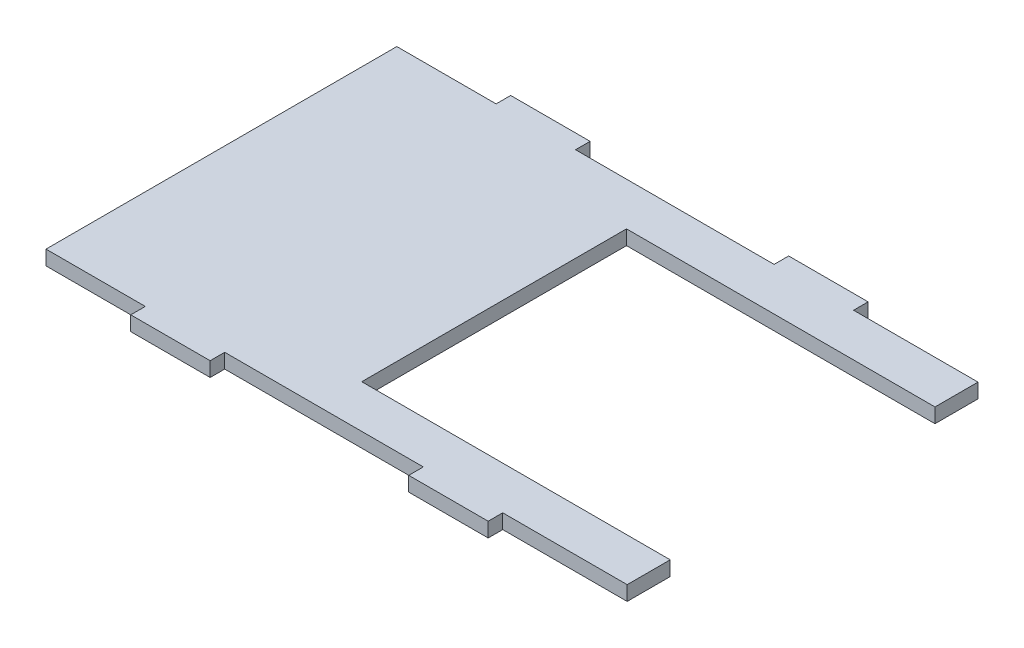
ISO-10303-21;
HEADER;
FILE_DESCRIPTION(('STEP AP214'),'2;1');
FILE_NAME('part.step','',(''),(''),'','','');
FILE_SCHEMA(('AUTOMOTIVE_DESIGN { 1 0 10303 214 1 1 1 1 }'));
ENDSEC;
DATA;
#1=APPLICATION_CONTEXT('core data for automotive mechanical design processes');
#2=APPLICATION_PROTOCOL_DEFINITION('international standard','automotive_design',2000,#1);
#3=PRODUCT_CONTEXT('',#1,'mechanical');
#4=PRODUCT('Part','Part','',(#3));
#5=PRODUCT_RELATED_PRODUCT_CATEGORY('part','',(#4));
#6=PRODUCT_DEFINITION_FORMATION('','',#4);
#7=PRODUCT_DEFINITION_CONTEXT('part definition',#1,'design');
#8=PRODUCT_DEFINITION('design','',#6,#7);
#9=PRODUCT_DEFINITION_SHAPE('','',#8);
#10=(LENGTH_UNIT() NAMED_UNIT(*) SI_UNIT(.MILLI.,.METRE.));
#11=(NAMED_UNIT(*) PLANE_ANGLE_UNIT() SI_UNIT($,.RADIAN.));
#12=(NAMED_UNIT(*) SI_UNIT($,.STERADIAN.) SOLID_ANGLE_UNIT());
#13=UNCERTAINTY_MEASURE_WITH_UNIT(LENGTH_MEASURE(1.E-05),#10,'distance_accuracy_value','');
#14=(GEOMETRIC_REPRESENTATION_CONTEXT(3) GLOBAL_UNCERTAINTY_ASSIGNED_CONTEXT((#13)) GLOBAL_UNIT_ASSIGNED_CONTEXT((#10,
#11,#12)) REPRESENTATION_CONTEXT('',''));
#15=CARTESIAN_POINT('',(0.,0.,0.));
#16=DIRECTION('',(0.,0.,1.));
#17=DIRECTION('',(1.,0.,0.));
#18=AXIS2_PLACEMENT_3D('',#15,#16,#17);
#19=CARTESIAN_POINT('',(0.,2.794,0.));
#20=DIRECTION('',(1.,0.,0.));
#21=DIRECTION('',(0.,0.,-1.));
#22=AXIS2_PLACEMENT_3D('',#19,#20,#21);
#23=PLANE('',#22);
#24=DIRECTION('',(0.,0.,1.));
#25=VECTOR('',#24,1.);
#26=CARTESIAN_POINT('',(0.,0.,0.));
#27=LINE('',#26,#25);
#28=CARTESIAN_POINT('',(0.,0.,-67.31));
#29=VERTEX_POINT('',#28);
#30=CARTESIAN_POINT('',(0.,0.,0.));
#31=VERTEX_POINT('',#30);
#32=EDGE_CURVE('E225',#29,#31,#27,.T.);
#33=ORIENTED_EDGE('',*,*,#32,.T.);
#34=DIRECTION('',(0.,-1.,0.));
#35=VECTOR('',#34,1.);
#36=CARTESIAN_POINT('',(0.,2.794,0.));
#37=LINE('',#36,#35);
#38=CARTESIAN_POINT('',(0.,2.794,0.));
#39=VERTEX_POINT('',#38);
#40=EDGE_CURVE('E11',#39,#31,#37,.T.);
#41=ORIENTED_EDGE('',*,*,#40,.F.);
#42=DIRECTION('',(0.,0.,1.));
#43=VECTOR('',#42,1.);
#44=CARTESIAN_POINT('',(0.,2.794,0.));
#45=LINE('',#44,#43);
#46=CARTESIAN_POINT('',(0.,2.794,-67.31));
#47=VERTEX_POINT('',#46);
#48=EDGE_CURVE('E271',#47,#39,#45,.T.);
#49=ORIENTED_EDGE('',*,*,#48,.F.);
#50=DIRECTION('',(0.,-1.,0.));
#51=VECTOR('',#50,1.);
#52=CARTESIAN_POINT('',(0.,2.794,-67.31));
#53=LINE('',#52,#51);
#54=EDGE_CURVE('E221',#47,#29,#53,.T.);
#55=ORIENTED_EDGE('',*,*,#54,.T.);
#56=EDGE_LOOP('',(#33,#41,#49,#55));
#57=FACE_BOUND('',#56,.T.);
#58=ADVANCED_FACE('F33',(#57),#23,.F.);
#59=CARTESIAN_POINT('',(0.,2.794,0.));
#60=DIRECTION('',(0.,0.,-1.));
#61=DIRECTION('',(-1.,0.,0.));
#62=AXIS2_PLACEMENT_3D('',#59,#60,#61);
#63=PLANE('',#62);
#64=DIRECTION('',(1.,0.,0.));
#65=VECTOR('',#64,1.);
#66=CARTESIAN_POINT('',(0.,0.,0.));
#67=LINE('',#66,#65);
#68=CARTESIAN_POINT('',(19.05,0.,0.));
#69=VERTEX_POINT('',#68);
#70=EDGE_CURVE('E228',#31,#69,#67,.T.);
#71=ORIENTED_EDGE('',*,*,#70,.T.);
#72=DIRECTION('',(0.,-1.,0.));
#73=VECTOR('',#72,1.);
#74=CARTESIAN_POINT('',(19.05,2.794,0.));
#75=LINE('',#74,#73);
#76=CARTESIAN_POINT('',(19.05,2.794,0.));
#77=VERTEX_POINT('',#76);
#78=EDGE_CURVE('E41',#77,#69,#75,.T.);
#79=ORIENTED_EDGE('',*,*,#78,.F.);
#80=DIRECTION('',(1.,0.,0.));
#81=VECTOR('',#80,1.);
#82=CARTESIAN_POINT('',(0.,2.794,0.));
#83=LINE('',#82,#81);
#84=EDGE_CURVE('E140',#39,#77,#83,.T.);
#85=ORIENTED_EDGE('',*,*,#84,.F.);
#86=ORIENTED_EDGE('',*,*,#40,.T.);
#87=EDGE_LOOP('',(#71,#79,#85,#86));
#88=FACE_BOUND('',#87,.T.);
#89=ADVANCED_FACE('F409',(#88),#63,.F.);
#90=CARTESIAN_POINT('',(19.05,2.794,0.));
#91=DIRECTION('',(1.,0.,0.));
#92=DIRECTION('',(0.,0.,-1.));
#93=AXIS2_PLACEMENT_3D('',#90,#91,#92);
#94=PLANE('',#93);
#95=DIRECTION('',(0.,0.,1.));
#96=VECTOR('',#95,1.);
#97=CARTESIAN_POINT('',(19.05,0.,0.));
#98=LINE('',#97,#96);
#99=CARTESIAN_POINT('',(19.05,0.,2.794));
#100=VERTEX_POINT('',#99);
#101=EDGE_CURVE('E230',#69,#100,#98,.T.);
#102=ORIENTED_EDGE('',*,*,#101,.T.);
#103=DIRECTION('',(0.,-1.,0.));
#104=VECTOR('',#103,1.);
#105=CARTESIAN_POINT('',(19.05,2.794,2.794));
#106=LINE('',#105,#104);
#107=CARTESIAN_POINT('',(19.05,2.794,2.794));
#108=VERTEX_POINT('',#107);
#109=EDGE_CURVE('E326',#108,#100,#106,.T.);
#110=ORIENTED_EDGE('',*,*,#109,.F.);
#111=DIRECTION('',(0.,0.,1.));
#112=VECTOR('',#111,1.);
#113=CARTESIAN_POINT('',(19.05,2.794,0.));
#114=LINE('',#113,#112);
#115=EDGE_CURVE('E334',#77,#108,#114,.T.);
#116=ORIENTED_EDGE('',*,*,#115,.F.);
#117=ORIENTED_EDGE('',*,*,#78,.T.);
#118=EDGE_LOOP('',(#102,#110,#116,#117));
#119=FACE_BOUND('',#118,.T.);
#120=ADVANCED_FACE('F332',(#119),#94,.F.);
#121=CARTESIAN_POINT('',(19.05,2.794,2.794));
#122=DIRECTION('',(0.,0.,-1.));
#123=DIRECTION('',(-1.,0.,0.));
#124=AXIS2_PLACEMENT_3D('',#121,#122,#123);
#125=PLANE('',#124);
#126=DIRECTION('',(1.,0.,0.));
#127=VECTOR('',#126,1.);
#128=CARTESIAN_POINT('',(19.05,0.,2.794));
#129=LINE('',#128,#127);
#130=CARTESIAN_POINT('',(34.29,0.,2.79399999999991));
#131=VERTEX_POINT('',#130);
#132=EDGE_CURVE('E232',#100,#131,#129,.T.);
#133=ORIENTED_EDGE('',*,*,#132,.T.);
#134=DIRECTION('',(0.,-1.,0.));
#135=VECTOR('',#134,1.);
#136=CARTESIAN_POINT('',(34.29,2.794,2.79399999999991));
#137=LINE('',#136,#135);
#138=CARTESIAN_POINT('',(34.29,2.794,2.79399999999991));
#139=VERTEX_POINT('',#138);
#140=EDGE_CURVE('E323',#139,#131,#137,.T.);
#141=ORIENTED_EDGE('',*,*,#140,.F.);
#142=DIRECTION('',(1.,0.,0.));
#143=VECTOR('',#142,1.);
#144=CARTESIAN_POINT('',(19.05,2.794,2.794));
#145=LINE('',#144,#143);
#146=EDGE_CURVE('E352',#108,#139,#145,.T.);
#147=ORIENTED_EDGE('',*,*,#146,.F.);
#148=ORIENTED_EDGE('',*,*,#109,.T.);
#149=EDGE_LOOP('',(#133,#141,#147,#148));
#150=FACE_BOUND('',#149,.T.);
#151=ADVANCED_FACE('F343',(#150),#125,.F.);
#152=CARTESIAN_POINT('',(34.29,2.794,0.));
#153=DIRECTION('',(-1.,0.,0.));
#154=DIRECTION('',(0.,0.,1.));
#155=AXIS2_PLACEMENT_3D('',#152,#153,#154);
#156=PLANE('',#155);
#157=DIRECTION('',(0.,0.,-1.));
#158=VECTOR('',#157,1.);
#159=CARTESIAN_POINT('',(34.29,0.,0.));
#160=LINE('',#159,#158);
#161=CARTESIAN_POINT('',(34.29,0.,0.));
#162=VERTEX_POINT('',#161);
#163=EDGE_CURVE('E234',#131,#162,#160,.T.);
#164=ORIENTED_EDGE('',*,*,#163,.T.);
#165=DIRECTION('',(0.,-1.,0.));
#166=VECTOR('',#165,1.);
#167=CARTESIAN_POINT('',(34.29,2.794,0.));
#168=LINE('',#167,#166);
#169=CARTESIAN_POINT('',(34.29,2.794,0.));
#170=VERTEX_POINT('',#169);
#171=EDGE_CURVE('E320',#170,#162,#168,.T.);
#172=ORIENTED_EDGE('',*,*,#171,.F.);
#173=DIRECTION('',(0.,0.,-1.));
#174=VECTOR('',#173,1.);
#175=CARTESIAN_POINT('',(34.29,2.794,0.));
#176=LINE('',#175,#174);
#177=EDGE_CURVE('E349',#139,#170,#176,.T.);
#178=ORIENTED_EDGE('',*,*,#177,.F.);
#179=ORIENTED_EDGE('',*,*,#140,.T.);
#180=EDGE_LOOP('',(#164,#172,#178,#179));
#181=FACE_BOUND('',#180,.T.);
#182=ADVANCED_FACE('F347',(#181),#156,.F.);
#183=CARTESIAN_POINT('',(34.29,2.794,0.));
#184=DIRECTION('',(0.,0.,-1.));
#185=DIRECTION('',(-1.,0.,0.));
#186=AXIS2_PLACEMENT_3D('',#183,#184,#185);
#187=PLANE('',#186);
#188=DIRECTION('',(1.,0.,0.));
#189=VECTOR('',#188,1.);
#190=CARTESIAN_POINT('',(34.29,0.,0.));
#191=LINE('',#190,#189);
#192=CARTESIAN_POINT('',(72.39,0.,0.));
#193=VERTEX_POINT('',#192);
#194=EDGE_CURVE('E236',#162,#193,#191,.T.);
#195=ORIENTED_EDGE('',*,*,#194,.T.);
#196=DIRECTION('',(0.,-1.,0.));
#197=VECTOR('',#196,1.);
#198=CARTESIAN_POINT('',(72.39,2.794,0.));
#199=LINE('',#198,#197);
#200=CARTESIAN_POINT('',(72.39,2.794,0.));
#201=VERTEX_POINT('',#200);
#202=EDGE_CURVE('E317',#201,#193,#199,.T.);
#203=ORIENTED_EDGE('',*,*,#202,.F.);
#204=DIRECTION('',(1.,0.,0.));
#205=VECTOR('',#204,1.);
#206=CARTESIAN_POINT('',(34.29,2.794,0.));
#207=LINE('',#206,#205);
#208=EDGE_CURVE('E351',#170,#201,#207,.T.);
#209=ORIENTED_EDGE('',*,*,#208,.F.);
#210=ORIENTED_EDGE('',*,*,#171,.T.);
#211=EDGE_LOOP('',(#195,#203,#209,#210));
#212=FACE_BOUND('',#211,.T.);
#213=ADVANCED_FACE('F422',(#212),#187,.F.);
#214=CARTESIAN_POINT('',(72.39,2.794,0.));
#215=DIRECTION('',(1.,0.,0.));
#216=DIRECTION('',(0.,0.,-1.));
#217=AXIS2_PLACEMENT_3D('',#214,#215,#216);
#218=PLANE('',#217);
#219=DIRECTION('',(0.,0.,1.));
#220=VECTOR('',#219,1.);
#221=CARTESIAN_POINT('',(72.39,0.,0.));
#222=LINE('',#221,#220);
#223=CARTESIAN_POINT('',(72.39,0.,2.79399999999998));
#224=VERTEX_POINT('',#223);
#225=EDGE_CURVE('E238',#193,#224,#222,.T.);
#226=ORIENTED_EDGE('',*,*,#225,.T.);
#227=DIRECTION('',(0.,-1.,0.));
#228=VECTOR('',#227,1.);
#229=CARTESIAN_POINT('',(72.39,2.794,2.79399999999998));
#230=LINE('',#229,#228);
#231=CARTESIAN_POINT('',(72.39,2.794,2.79399999999998));
#232=VERTEX_POINT('',#231);
#233=EDGE_CURVE('E314',#232,#224,#230,.T.);
#234=ORIENTED_EDGE('',*,*,#233,.F.);
#235=DIRECTION('',(0.,0.,1.));
#236=VECTOR('',#235,1.);
#237=CARTESIAN_POINT('',(72.39,2.794,0.));
#238=LINE('',#237,#236);
#239=EDGE_CURVE('E354',#201,#232,#238,.T.);
#240=ORIENTED_EDGE('',*,*,#239,.F.);
#241=ORIENTED_EDGE('',*,*,#202,.T.);
#242=EDGE_LOOP('',(#226,#234,#240,#241));
#243=FACE_BOUND('',#242,.T.);
#244=ADVANCED_FACE('F425',(#243),#218,.F.);
#245=CARTESIAN_POINT('',(72.39,2.794,2.79399999999998));
#246=DIRECTION('',(0.,0.,-1.));
#247=DIRECTION('',(-1.,0.,0.));
#248=AXIS2_PLACEMENT_3D('',#245,#246,#247);
#249=PLANE('',#248);
#250=DIRECTION('',(1.,0.,0.));
#251=VECTOR('',#250,1.);
#252=CARTESIAN_POINT('',(72.39,0.,2.79399999999998));
#253=LINE('',#252,#251);
#254=CARTESIAN_POINT('',(87.6299998357619,0.,2.79399999999998));
#255=VERTEX_POINT('',#254);
#256=EDGE_CURVE('E240',#224,#255,#253,.T.);
#257=ORIENTED_EDGE('',*,*,#256,.T.);
#258=DIRECTION('',(0.,-1.,0.));
#259=VECTOR('',#258,1.);
#260=CARTESIAN_POINT('',(87.6299998357619,2.794,2.79399999999998));
#261=LINE('',#260,#259);
#262=CARTESIAN_POINT('',(87.6299998357619,2.794,2.79399999999998));
#263=VERTEX_POINT('',#262);
#264=EDGE_CURVE('E311',#263,#255,#261,.T.);
#265=ORIENTED_EDGE('',*,*,#264,.F.);
#266=DIRECTION('',(1.,0.,0.));
#267=VECTOR('',#266,1.);
#268=CARTESIAN_POINT('',(72.39,2.794,2.79399999999998));
#269=LINE('',#268,#267);
#270=EDGE_CURVE('E360',#232,#263,#269,.T.);
#271=ORIENTED_EDGE('',*,*,#270,.F.);
#272=ORIENTED_EDGE('',*,*,#233,.T.);
#273=EDGE_LOOP('',(#257,#265,#271,#272));
#274=FACE_BOUND('',#273,.T.);
#275=ADVANCED_FACE('F429',(#274),#249,.F.);
#276=CARTESIAN_POINT('',(87.6299998357619,2.794,0.));
#277=DIRECTION('',(-1.,0.,0.));
#278=DIRECTION('',(0.,0.,1.));
#279=AXIS2_PLACEMENT_3D('',#276,#277,#278);
#280=PLANE('',#279);
#281=DIRECTION('',(0.,0.,-1.));
#282=VECTOR('',#281,1.);
#283=CARTESIAN_POINT('',(87.6299998357619,0.,0.));
#284=LINE('',#283,#282);
#285=CARTESIAN_POINT('',(87.6299998357619,0.,0.));
#286=VERTEX_POINT('',#285);
#287=EDGE_CURVE('E242',#255,#286,#284,.T.);
#288=ORIENTED_EDGE('',*,*,#287,.T.);
#289=DIRECTION('',(0.,-1.,0.));
#290=VECTOR('',#289,1.);
#291=CARTESIAN_POINT('',(87.6299998357619,2.794,0.));
#292=LINE('',#291,#290);
#293=CARTESIAN_POINT('',(87.6299998357619,2.794,0.));
#294=VERTEX_POINT('',#293);
#295=EDGE_CURVE('E308',#294,#286,#292,.T.);
#296=ORIENTED_EDGE('',*,*,#295,.F.);
#297=DIRECTION('',(0.,0.,-1.));
#298=VECTOR('',#297,1.);
#299=CARTESIAN_POINT('',(87.6299998357619,2.794,0.));
#300=LINE('',#299,#298);
#301=EDGE_CURVE('E362',#263,#294,#300,.T.);
#302=ORIENTED_EDGE('',*,*,#301,.F.);
#303=ORIENTED_EDGE('',*,*,#264,.T.);
#304=EDGE_LOOP('',(#288,#296,#302,#303));
#305=FACE_BOUND('',#304,.T.);
#306=ADVANCED_FACE('F433',(#305),#280,.F.);
#307=CARTESIAN_POINT('',(87.6299998357619,2.794,0.));
#308=DIRECTION('',(0.,0.,-1.));
#309=DIRECTION('',(-1.,0.,0.));
#310=AXIS2_PLACEMENT_3D('',#307,#308,#309);
#311=PLANE('',#310);
#312=DIRECTION('',(1.,0.,0.));
#313=VECTOR('',#312,1.);
#314=CARTESIAN_POINT('',(87.6299998357619,0.,0.));
#315=LINE('',#314,#313);
#316=CARTESIAN_POINT('',(111.506,0.,0.));
#317=VERTEX_POINT('',#316);
#318=EDGE_CURVE('E244',#286,#317,#315,.T.);
#319=ORIENTED_EDGE('',*,*,#318,.T.);
#320=DIRECTION('',(0.,-1.,0.));
#321=VECTOR('',#320,1.);
#322=CARTESIAN_POINT('',(111.506,2.794,0.));
#323=LINE('',#322,#321);
#324=CARTESIAN_POINT('',(111.506,2.794,0.));
#325=VERTEX_POINT('',#324);
#326=EDGE_CURVE('E305',#325,#317,#323,.T.);
#327=ORIENTED_EDGE('',*,*,#326,.F.);
#328=DIRECTION('',(1.,0.,0.));
#329=VECTOR('',#328,1.);
#330=CARTESIAN_POINT('',(87.6299998357619,2.794,0.));
#331=LINE('',#330,#329);
#332=EDGE_CURVE('E364',#294,#325,#331,.T.);
#333=ORIENTED_EDGE('',*,*,#332,.F.);
#334=ORIENTED_EDGE('',*,*,#295,.T.);
#335=EDGE_LOOP('',(#319,#327,#333,#334));
#336=FACE_BOUND('',#335,.T.);
#337=ADVANCED_FACE('F437',(#336),#311,.F.);
#338=CARTESIAN_POINT('',(111.506,2.794,0.));
#339=DIRECTION('',(-1.,0.,0.));
#340=DIRECTION('',(0.,0.,1.));
#341=AXIS2_PLACEMENT_3D('',#338,#339,#340);
#342=PLANE('',#341);
#343=DIRECTION('',(0.,0.,-1.));
#344=VECTOR('',#343,1.);
#345=CARTESIAN_POINT('',(111.506,0.,0.));
#346=LINE('',#345,#344);
#347=CARTESIAN_POINT('',(111.506,0.,-8.255));
#348=VERTEX_POINT('',#347);
#349=EDGE_CURVE('E246',#317,#348,#346,.T.);
#350=ORIENTED_EDGE('',*,*,#349,.T.);
#351=DIRECTION('',(0.,-1.,0.));
#352=VECTOR('',#351,1.);
#353=CARTESIAN_POINT('',(111.506,2.794,-8.255));
#354=LINE('',#353,#352);
#355=CARTESIAN_POINT('',(111.506,2.794,-8.255));
#356=VERTEX_POINT('',#355);
#357=EDGE_CURVE('E302',#356,#348,#354,.T.);
#358=ORIENTED_EDGE('',*,*,#357,.F.);
#359=DIRECTION('',(0.,0.,-1.));
#360=VECTOR('',#359,1.);
#361=CARTESIAN_POINT('',(111.506,2.794,0.));
#362=LINE('',#361,#360);
#363=EDGE_CURVE('E366',#325,#356,#362,.T.);
#364=ORIENTED_EDGE('',*,*,#363,.F.);
#365=ORIENTED_EDGE('',*,*,#326,.T.);
#366=EDGE_LOOP('',(#350,#358,#364,#365));
#367=FACE_BOUND('',#366,.T.);
#368=ADVANCED_FACE('F441',(#367),#342,.F.);
#369=CARTESIAN_POINT('',(111.506,2.794,-8.255));
#370=DIRECTION('',(0.,0.,1.));
#371=DIRECTION('',(1.,0.,0.));
#372=AXIS2_PLACEMENT_3D('',#369,#370,#371);
#373=PLANE('',#372);
#374=DIRECTION('',(-1.,0.,0.));
#375=VECTOR('',#374,1.);
#376=CARTESIAN_POINT('',(111.506,0.,-8.255));
#377=LINE('',#376,#375);
#378=CARTESIAN_POINT('',(52.324,0.,-8.255));
#379=VERTEX_POINT('',#378);
#380=EDGE_CURVE('E248',#348,#379,#377,.T.);
#381=ORIENTED_EDGE('',*,*,#380,.T.);
#382=DIRECTION('',(0.,-1.,0.));
#383=VECTOR('',#382,1.);
#384=CARTESIAN_POINT('',(52.324,2.794,-8.255));
#385=LINE('',#384,#383);
#386=CARTESIAN_POINT('',(52.324,2.794,-8.255));
#387=VERTEX_POINT('',#386);
#388=EDGE_CURVE('E299',#387,#379,#385,.T.);
#389=ORIENTED_EDGE('',*,*,#388,.F.);
#390=DIRECTION('',(-1.,0.,0.));
#391=VECTOR('',#390,1.);
#392=CARTESIAN_POINT('',(111.506,2.794,-8.255));
#393=LINE('',#392,#391);
#394=EDGE_CURVE('E368',#356,#387,#393,.T.);
#395=ORIENTED_EDGE('',*,*,#394,.F.);
#396=ORIENTED_EDGE('',*,*,#357,.T.);
#397=EDGE_LOOP('',(#381,#389,#395,#396));
#398=FACE_BOUND('',#397,.T.);
#399=ADVANCED_FACE('F445',(#398),#373,.F.);
#400=CARTESIAN_POINT('',(52.324,2.794,-8.255));
#401=DIRECTION('',(-1.,0.,0.));
#402=DIRECTION('',(0.,0.,1.));
#403=AXIS2_PLACEMENT_3D('',#400,#401,#402);
#404=PLANE('',#403);
#405=DIRECTION('',(0.,0.,-1.));
#406=VECTOR('',#405,1.);
#407=CARTESIAN_POINT('',(52.324,0.,-8.255));
#408=LINE('',#407,#406);
#409=CARTESIAN_POINT('',(52.324,0.,-59.055));
#410=VERTEX_POINT('',#409);
#411=EDGE_CURVE('E250',#379,#410,#408,.T.);
#412=ORIENTED_EDGE('',*,*,#411,.T.);
#413=DIRECTION('',(0.,-1.,0.));
#414=VECTOR('',#413,1.);
#415=CARTESIAN_POINT('',(52.324,2.794,-59.055));
#416=LINE('',#415,#414);
#417=CARTESIAN_POINT('',(52.324,2.794,-59.055));
#418=VERTEX_POINT('',#417);
#419=EDGE_CURVE('E296',#418,#410,#416,.T.);
#420=ORIENTED_EDGE('',*,*,#419,.F.);
#421=DIRECTION('',(0.,0.,-1.));
#422=VECTOR('',#421,1.);
#423=CARTESIAN_POINT('',(52.324,2.794,-8.255));
#424=LINE('',#423,#422);
#425=EDGE_CURVE('E370',#387,#418,#424,.T.);
#426=ORIENTED_EDGE('',*,*,#425,.F.);
#427=ORIENTED_EDGE('',*,*,#388,.T.);
#428=EDGE_LOOP('',(#412,#420,#426,#427));
#429=FACE_BOUND('',#428,.T.);
#430=ADVANCED_FACE('F449',(#429),#404,.F.);
#431=CARTESIAN_POINT('',(111.506,2.794,-59.055));
#432=DIRECTION('',(0.,0.,-1.));
#433=DIRECTION('',(-1.,0.,0.));
#434=AXIS2_PLACEMENT_3D('',#431,#432,#433);
#435=PLANE('',#434);
#436=DIRECTION('',(1.,0.,0.));
#437=VECTOR('',#436,1.);
#438=CARTESIAN_POINT('',(111.506,0.,-59.055));
#439=LINE('',#438,#437);
#440=CARTESIAN_POINT('',(111.506,0.,-59.055));
#441=VERTEX_POINT('',#440);
#442=EDGE_CURVE('E252',#410,#441,#439,.T.);
#443=ORIENTED_EDGE('',*,*,#442,.T.);
#444=DIRECTION('',(0.,-1.,0.));
#445=VECTOR('',#444,1.);
#446=CARTESIAN_POINT('',(111.506,2.794,-59.055));
#447=LINE('',#446,#445);
#448=CARTESIAN_POINT('',(111.506,2.794,-59.055));
#449=VERTEX_POINT('',#448);
#450=EDGE_CURVE('E293',#449,#441,#447,.T.);
#451=ORIENTED_EDGE('',*,*,#450,.F.);
#452=DIRECTION('',(1.,0.,0.));
#453=VECTOR('',#452,1.);
#454=CARTESIAN_POINT('',(111.506,2.794,-59.055));
#455=LINE('',#454,#453);
#456=EDGE_CURVE('E372',#418,#449,#455,.T.);
#457=ORIENTED_EDGE('',*,*,#456,.F.);
#458=ORIENTED_EDGE('',*,*,#419,.T.);
#459=EDGE_LOOP('',(#443,#451,#457,#458));
#460=FACE_BOUND('',#459,.T.);
#461=ADVANCED_FACE('F453',(#460),#435,.F.);
#462=CARTESIAN_POINT('',(111.506,2.794,-59.055));
#463=DIRECTION('',(-1.,0.,0.));
#464=DIRECTION('',(0.,0.,1.));
#465=AXIS2_PLACEMENT_3D('',#462,#463,#464);
#466=PLANE('',#465);
#467=DIRECTION('',(0.,0.,-1.));
#468=VECTOR('',#467,1.);
#469=CARTESIAN_POINT('',(111.506,0.,-59.055));
#470=LINE('',#469,#468);
#471=CARTESIAN_POINT('',(111.506,0.,-67.31));
#472=VERTEX_POINT('',#471);
#473=EDGE_CURVE('E254',#441,#472,#470,.T.);
#474=ORIENTED_EDGE('',*,*,#473,.T.);
#475=DIRECTION('',(0.,-1.,0.));
#476=VECTOR('',#475,1.);
#477=CARTESIAN_POINT('',(111.506,2.794,-67.31));
#478=LINE('',#477,#476);
#479=CARTESIAN_POINT('',(111.506,2.794,-67.31));
#480=VERTEX_POINT('',#479);
#481=EDGE_CURVE('E290',#480,#472,#478,.T.);
#482=ORIENTED_EDGE('',*,*,#481,.F.);
#483=DIRECTION('',(0.,0.,-1.));
#484=VECTOR('',#483,1.);
#485=CARTESIAN_POINT('',(111.506,2.794,-59.055));
#486=LINE('',#485,#484);
#487=EDGE_CURVE('E374',#449,#480,#486,.T.);
#488=ORIENTED_EDGE('',*,*,#487,.F.);
#489=ORIENTED_EDGE('',*,*,#450,.T.);
#490=EDGE_LOOP('',(#474,#482,#488,#489));
#491=FACE_BOUND('',#490,.T.);
#492=ADVANCED_FACE('F457',(#491),#466,.F.);
#493=CARTESIAN_POINT('',(87.6299998357619,2.794,-67.31));
#494=DIRECTION('',(0.,0.,1.));
#495=DIRECTION('',(1.,0.,0.));
#496=AXIS2_PLACEMENT_3D('',#493,#494,#495);
#497=PLANE('',#496);
#498=DIRECTION('',(-1.,0.,0.));
#499=VECTOR('',#498,1.);
#500=CARTESIAN_POINT('',(87.6299998357619,0.,-67.31));
#501=LINE('',#500,#499);
#502=CARTESIAN_POINT('',(87.6299998357619,0.,-67.31));
#503=VERTEX_POINT('',#502);
#504=EDGE_CURVE('E256',#472,#503,#501,.T.);
#505=ORIENTED_EDGE('',*,*,#504,.T.);
#506=DIRECTION('',(0.,-1.,0.));
#507=VECTOR('',#506,1.);
#508=CARTESIAN_POINT('',(87.6299998357619,2.794,-67.31));
#509=LINE('',#508,#507);
#510=CARTESIAN_POINT('',(87.6299998357619,2.794,-67.31));
#511=VERTEX_POINT('',#510);
#512=EDGE_CURVE('E287',#511,#503,#509,.T.);
#513=ORIENTED_EDGE('',*,*,#512,.F.);
#514=DIRECTION('',(-1.,0.,0.));
#515=VECTOR('',#514,1.);
#516=CARTESIAN_POINT('',(87.6299998357619,2.794,-67.31));
#517=LINE('',#516,#515);
#518=EDGE_CURVE('E376',#480,#511,#517,.T.);
#519=ORIENTED_EDGE('',*,*,#518,.F.);
#520=ORIENTED_EDGE('',*,*,#481,.T.);
#521=EDGE_LOOP('',(#505,#513,#519,#520));
#522=FACE_BOUND('',#521,.T.);
#523=ADVANCED_FACE('F461',(#522),#497,.F.);
#524=CARTESIAN_POINT('',(87.6299998357619,2.794,-70.104));
#525=DIRECTION('',(-1.,0.,0.));
#526=DIRECTION('',(0.,0.,1.));
#527=AXIS2_PLACEMENT_3D('',#524,#525,#526);
#528=PLANE('',#527);
#529=DIRECTION('',(0.,0.,-1.));
#530=VECTOR('',#529,1.);
#531=CARTESIAN_POINT('',(87.6299998357619,0.,-70.104));
#532=LINE('',#531,#530);
#533=CARTESIAN_POINT('',(87.6299998357619,0.,-70.104));
#534=VERTEX_POINT('',#533);
#535=EDGE_CURVE('E258',#503,#534,#532,.T.);
#536=ORIENTED_EDGE('',*,*,#535,.T.);
#537=DIRECTION('',(0.,-1.,0.));
#538=VECTOR('',#537,1.);
#539=CARTESIAN_POINT('',(87.6299998357619,2.794,-70.104));
#540=LINE('',#539,#538);
#541=CARTESIAN_POINT('',(87.6299998357619,2.794,-70.104));
#542=VERTEX_POINT('',#541);
#543=EDGE_CURVE('E284',#542,#534,#540,.T.);
#544=ORIENTED_EDGE('',*,*,#543,.F.);
#545=DIRECTION('',(0.,0.,-1.));
#546=VECTOR('',#545,1.);
#547=CARTESIAN_POINT('',(87.6299998357619,2.794,-70.104));
#548=LINE('',#547,#546);
#549=EDGE_CURVE('E378',#511,#542,#548,.T.);
#550=ORIENTED_EDGE('',*,*,#549,.F.);
#551=ORIENTED_EDGE('',*,*,#512,.T.);
#552=EDGE_LOOP('',(#536,#544,#550,#551));
#553=FACE_BOUND('',#552,.T.);
#554=ADVANCED_FACE('F465',(#553),#528,.F.);
#555=CARTESIAN_POINT('',(72.39,2.794,-70.104));
#556=DIRECTION('',(0.,0.,1.));
#557=DIRECTION('',(1.,0.,0.));
#558=AXIS2_PLACEMENT_3D('',#555,#556,#557);
#559=PLANE('',#558);
#560=DIRECTION('',(-1.,0.,0.));
#561=VECTOR('',#560,1.);
#562=CARTESIAN_POINT('',(72.39,0.,-70.104));
#563=LINE('',#562,#561);
#564=CARTESIAN_POINT('',(72.39,0.,-70.104));
#565=VERTEX_POINT('',#564);
#566=EDGE_CURVE('E260',#534,#565,#563,.T.);
#567=ORIENTED_EDGE('',*,*,#566,.T.);
#568=DIRECTION('',(0.,-1.,0.));
#569=VECTOR('',#568,1.);
#570=CARTESIAN_POINT('',(72.39,2.794,-70.104));
#571=LINE('',#570,#569);
#572=CARTESIAN_POINT('',(72.39,2.794,-70.104));
#573=VERTEX_POINT('',#572);
#574=EDGE_CURVE('E281',#573,#565,#571,.T.);
#575=ORIENTED_EDGE('',*,*,#574,.F.);
#576=DIRECTION('',(-1.,0.,0.));
#577=VECTOR('',#576,1.);
#578=CARTESIAN_POINT('',(72.39,2.794,-70.104));
#579=LINE('',#578,#577);
#580=EDGE_CURVE('E380',#542,#573,#579,.T.);
#581=ORIENTED_EDGE('',*,*,#580,.F.);
#582=ORIENTED_EDGE('',*,*,#543,.T.);
#583=EDGE_LOOP('',(#567,#575,#581,#582));
#584=FACE_BOUND('',#583,.T.);
#585=ADVANCED_FACE('F469',(#584),#559,.F.);
#586=CARTESIAN_POINT('',(72.39,2.794,-70.104));
#587=DIRECTION('',(1.,0.,0.));
#588=DIRECTION('',(0.,0.,-1.));
#589=AXIS2_PLACEMENT_3D('',#586,#587,#588);
#590=PLANE('',#589);
#591=DIRECTION('',(0.,0.,1.));
#592=VECTOR('',#591,1.);
#593=CARTESIAN_POINT('',(72.39,0.,-70.104));
#594=LINE('',#593,#592);
#595=CARTESIAN_POINT('',(72.39,0.,-67.31));
#596=VERTEX_POINT('',#595);
#597=EDGE_CURVE('E262',#565,#596,#594,.T.);
#598=ORIENTED_EDGE('',*,*,#597,.T.);
#599=DIRECTION('',(0.,-1.,0.));
#600=VECTOR('',#599,1.);
#601=CARTESIAN_POINT('',(72.39,2.794,-67.31));
#602=LINE('',#601,#600);
#603=CARTESIAN_POINT('',(72.39,2.794,-67.31));
#604=VERTEX_POINT('',#603);
#605=EDGE_CURVE('E278',#604,#596,#602,.T.);
#606=ORIENTED_EDGE('',*,*,#605,.F.);
#607=DIRECTION('',(0.,0.,1.));
#608=VECTOR('',#607,1.);
#609=CARTESIAN_POINT('',(72.39,2.794,-70.104));
#610=LINE('',#609,#608);
#611=EDGE_CURVE('E382',#573,#604,#610,.T.);
#612=ORIENTED_EDGE('',*,*,#611,.F.);
#613=ORIENTED_EDGE('',*,*,#574,.T.);
#614=EDGE_LOOP('',(#598,#606,#612,#613));
#615=FACE_BOUND('',#614,.T.);
#616=ADVANCED_FACE('F473',(#615),#590,.F.);
#617=CARTESIAN_POINT('',(34.29,2.794,-67.31));
#618=DIRECTION('',(0.,0.,1.));
#619=DIRECTION('',(1.,0.,0.));
#620=AXIS2_PLACEMENT_3D('',#617,#618,#619);
#621=PLANE('',#620);
#622=DIRECTION('',(-1.,0.,0.));
#623=VECTOR('',#622,1.);
#624=CARTESIAN_POINT('',(34.29,0.,-67.31));
#625=LINE('',#624,#623);
#626=CARTESIAN_POINT('',(34.29,0.,-67.31));
#627=VERTEX_POINT('',#626);
#628=EDGE_CURVE('E264',#596,#627,#625,.T.);
#629=ORIENTED_EDGE('',*,*,#628,.T.);
#630=DIRECTION('',(0.,-1.,0.));
#631=VECTOR('',#630,1.);
#632=CARTESIAN_POINT('',(34.29,2.794,-67.31));
#633=LINE('',#632,#631);
#634=CARTESIAN_POINT('',(34.29,2.794,-67.31));
#635=VERTEX_POINT('',#634);
#636=EDGE_CURVE('E275',#635,#627,#633,.T.);
#637=ORIENTED_EDGE('',*,*,#636,.F.);
#638=DIRECTION('',(-1.,0.,0.));
#639=VECTOR('',#638,1.);
#640=CARTESIAN_POINT('',(34.29,2.794,-67.31));
#641=LINE('',#640,#639);
#642=EDGE_CURVE('E384',#604,#635,#641,.T.);
#643=ORIENTED_EDGE('',*,*,#642,.F.);
#644=ORIENTED_EDGE('',*,*,#605,.T.);
#645=EDGE_LOOP('',(#629,#637,#643,#644));
#646=FACE_BOUND('',#645,.T.);
#647=ADVANCED_FACE('F390',(#646),#621,.F.);
#648=CARTESIAN_POINT('',(34.29,2.794,-70.104));
#649=DIRECTION('',(-1.,0.,0.));
#650=DIRECTION('',(0.,0.,1.));
#651=AXIS2_PLACEMENT_3D('',#648,#649,#650);
#652=PLANE('',#651);
#653=DIRECTION('',(0.,0.,-1.));
#654=VECTOR('',#653,1.);
#655=CARTESIAN_POINT('',(34.29,0.,-70.104));
#656=LINE('',#655,#654);
#657=CARTESIAN_POINT('',(34.29,0.,-70.104));
#658=VERTEX_POINT('',#657);
#659=EDGE_CURVE('E266',#627,#658,#656,.T.);
#660=ORIENTED_EDGE('',*,*,#659,.T.);
#661=DIRECTION('',(0.,-1.,0.));
#662=VECTOR('',#661,1.);
#663=CARTESIAN_POINT('',(34.29,2.794,-70.104));
#664=LINE('',#663,#662);
#665=CARTESIAN_POINT('',(34.29,2.794,-70.104));
#666=VERTEX_POINT('',#665);
#667=EDGE_CURVE('E216',#666,#658,#664,.T.);
#668=ORIENTED_EDGE('',*,*,#667,.F.);
#669=DIRECTION('',(0.,0.,-1.));
#670=VECTOR('',#669,1.);
#671=CARTESIAN_POINT('',(34.29,2.794,-70.104));
#672=LINE('',#671,#670);
#673=EDGE_CURVE('E207',#635,#666,#672,.T.);
#674=ORIENTED_EDGE('',*,*,#673,.F.);
#675=ORIENTED_EDGE('',*,*,#636,.T.);
#676=EDGE_LOOP('',(#660,#668,#674,#675));
#677=FACE_BOUND('',#676,.T.);
#678=ADVANCED_FACE('F394',(#677),#652,.F.);
#679=CARTESIAN_POINT('',(19.05,2.794,-70.104));
#680=DIRECTION('',(0.,0.,1.));
#681=DIRECTION('',(1.,0.,0.));
#682=AXIS2_PLACEMENT_3D('',#679,#680,#681);
#683=PLANE('',#682);
#684=DIRECTION('',(-1.,0.,0.));
#685=VECTOR('',#684,1.);
#686=CARTESIAN_POINT('',(19.05,0.,-70.104));
#687=LINE('',#686,#685);
#688=CARTESIAN_POINT('',(19.05,0.,-70.104));
#689=VERTEX_POINT('',#688);
#690=EDGE_CURVE('E215',#658,#689,#687,.T.);
#691=ORIENTED_EDGE('',*,*,#690,.T.);
#692=DIRECTION('',(0.,-1.,0.));
#693=VECTOR('',#692,1.);
#694=CARTESIAN_POINT('',(19.05,2.794,-70.104));
#695=LINE('',#694,#693);
#696=CARTESIAN_POINT('',(19.05,2.794,-70.104));
#697=VERTEX_POINT('',#696);
#698=EDGE_CURVE('E212',#697,#689,#695,.T.);
#699=ORIENTED_EDGE('',*,*,#698,.F.);
#700=DIRECTION('',(-1.,0.,0.));
#701=VECTOR('',#700,1.);
#702=CARTESIAN_POINT('',(19.05,2.794,-70.104));
#703=LINE('',#702,#701);
#704=EDGE_CURVE('E201',#666,#697,#703,.T.);
#705=ORIENTED_EDGE('',*,*,#704,.F.);
#706=ORIENTED_EDGE('',*,*,#667,.T.);
#707=EDGE_LOOP('',(#691,#699,#705,#706));
#708=FACE_BOUND('',#707,.T.);
#709=ADVANCED_FACE('F213',(#708),#683,.F.);
#710=CARTESIAN_POINT('',(19.05,2.794,-70.104));
#711=DIRECTION('',(1.,0.,0.));
#712=DIRECTION('',(0.,0.,-1.));
#713=AXIS2_PLACEMENT_3D('',#710,#711,#712);
#714=PLANE('',#713);
#715=DIRECTION('',(0.,0.,1.));
#716=VECTOR('',#715,1.);
#717=CARTESIAN_POINT('',(19.05,0.,-70.104));
#718=LINE('',#717,#716);
#719=CARTESIAN_POINT('',(19.05,0.,-67.31));
#720=VERTEX_POINT('',#719);
#721=EDGE_CURVE('E126',#689,#720,#718,.T.);
#722=ORIENTED_EDGE('',*,*,#721,.T.);
#723=DIRECTION('',(0.,-1.,0.));
#724=VECTOR('',#723,1.);
#725=CARTESIAN_POINT('',(19.05,2.794,-67.31));
#726=LINE('',#725,#724);
#727=CARTESIAN_POINT('',(19.05,2.794,-67.31));
#728=VERTEX_POINT('',#727);
#729=EDGE_CURVE('E217',#728,#720,#726,.T.);
#730=ORIENTED_EDGE('',*,*,#729,.F.);
#731=DIRECTION('',(0.,0.,1.));
#732=VECTOR('',#731,1.);
#733=CARTESIAN_POINT('',(19.05,2.794,-70.104));
#734=LINE('',#733,#732);
#735=EDGE_CURVE('E205',#697,#728,#734,.T.);
#736=ORIENTED_EDGE('',*,*,#735,.F.);
#737=ORIENTED_EDGE('',*,*,#698,.T.);
#738=EDGE_LOOP('',(#722,#730,#736,#737));
#739=FACE_BOUND('',#738,.T.);
#740=ADVANCED_FACE('F219',(#739),#714,.F.);
#741=CARTESIAN_POINT('',(0.,2.794,-67.31));
#742=DIRECTION('',(0.,0.,1.));
#743=DIRECTION('',(1.,0.,0.));
#744=AXIS2_PLACEMENT_3D('',#741,#742,#743);
#745=PLANE('',#744);
#746=DIRECTION('',(-1.,0.,0.));
#747=VECTOR('',#746,1.);
#748=CARTESIAN_POINT('',(0.,0.,-67.31));
#749=LINE('',#748,#747);
#750=EDGE_CURVE('E132',#720,#29,#749,.T.);
#751=ORIENTED_EDGE('',*,*,#750,.T.);
#752=ORIENTED_EDGE('',*,*,#54,.F.);
#753=DIRECTION('',(-1.,0.,0.));
#754=VECTOR('',#753,1.);
#755=CARTESIAN_POINT('',(0.,2.794,-67.31));
#756=LINE('',#755,#754);
#757=EDGE_CURVE('E49',#728,#47,#756,.T.);
#758=ORIENTED_EDGE('',*,*,#757,.F.);
#759=ORIENTED_EDGE('',*,*,#729,.T.);
#760=EDGE_LOOP('',(#751,#752,#758,#759));
#761=FACE_BOUND('',#760,.T.);
#762=ADVANCED_FACE('F398',(#761),#745,.F.);
#763=CARTESIAN_POINT('',(0.,2.794,0.));
#764=DIRECTION('',(0.,-1.,0.));
#765=DIRECTION('',(0.,0.,-1.));
#766=AXIS2_PLACEMENT_3D('',#763,#764,#765);
#767=PLANE('',#766);
#768=ORIENTED_EDGE('',*,*,#48,.T.);
#769=ORIENTED_EDGE('',*,*,#84,.T.);
#770=ORIENTED_EDGE('',*,*,#115,.T.);
#771=ORIENTED_EDGE('',*,*,#146,.T.);
#772=ORIENTED_EDGE('',*,*,#177,.T.);
#773=ORIENTED_EDGE('',*,*,#208,.T.);
#774=ORIENTED_EDGE('',*,*,#239,.T.);
#775=ORIENTED_EDGE('',*,*,#270,.T.);
#776=ORIENTED_EDGE('',*,*,#301,.T.);
#777=ORIENTED_EDGE('',*,*,#332,.T.);
#778=ORIENTED_EDGE('',*,*,#363,.T.);
#779=ORIENTED_EDGE('',*,*,#394,.T.);
#780=ORIENTED_EDGE('',*,*,#425,.T.);
#781=ORIENTED_EDGE('',*,*,#456,.T.);
#782=ORIENTED_EDGE('',*,*,#487,.T.);
#783=ORIENTED_EDGE('',*,*,#518,.T.);
#784=ORIENTED_EDGE('',*,*,#549,.T.);
#785=ORIENTED_EDGE('',*,*,#580,.T.);
#786=ORIENTED_EDGE('',*,*,#611,.T.);
#787=ORIENTED_EDGE('',*,*,#642,.T.);
#788=ORIENTED_EDGE('',*,*,#673,.T.);
#789=ORIENTED_EDGE('',*,*,#704,.T.);
#790=ORIENTED_EDGE('',*,*,#735,.T.);
#791=ORIENTED_EDGE('',*,*,#757,.T.);
#792=EDGE_LOOP('',(#768,#769,#770,#771,#772,#773,#774,#775,#776,#777,#778,#779,#780,#781,#782,
#783,#784,#785,#786,#787,#788,#789,#790,#791));
#793=FACE_BOUND('',#792,.T.);
#794=ADVANCED_FACE('F203',(#793),#767,.F.);
#795=CARTESIAN_POINT('',(0.,0.,0.));
#796=DIRECTION('',(0.,-1.,0.));
#797=DIRECTION('',(0.,0.,-1.));
#798=AXIS2_PLACEMENT_3D('',#795,#796,#797);
#799=PLANE('',#798);
#800=ORIENTED_EDGE('',*,*,#32,.F.);
#801=ORIENTED_EDGE('',*,*,#750,.F.);
#802=ORIENTED_EDGE('',*,*,#721,.F.);
#803=ORIENTED_EDGE('',*,*,#690,.F.);
#804=ORIENTED_EDGE('',*,*,#659,.F.);
#805=ORIENTED_EDGE('',*,*,#628,.F.);
#806=ORIENTED_EDGE('',*,*,#597,.F.);
#807=ORIENTED_EDGE('',*,*,#566,.F.);
#808=ORIENTED_EDGE('',*,*,#535,.F.);
#809=ORIENTED_EDGE('',*,*,#504,.F.);
#810=ORIENTED_EDGE('',*,*,#473,.F.);
#811=ORIENTED_EDGE('',*,*,#442,.F.);
#812=ORIENTED_EDGE('',*,*,#411,.F.);
#813=ORIENTED_EDGE('',*,*,#380,.F.);
#814=ORIENTED_EDGE('',*,*,#349,.F.);
#815=ORIENTED_EDGE('',*,*,#318,.F.);
#816=ORIENTED_EDGE('',*,*,#287,.F.);
#817=ORIENTED_EDGE('',*,*,#256,.F.);
#818=ORIENTED_EDGE('',*,*,#225,.F.);
#819=ORIENTED_EDGE('',*,*,#194,.F.);
#820=ORIENTED_EDGE('',*,*,#163,.F.);
#821=ORIENTED_EDGE('',*,*,#132,.F.);
#822=ORIENTED_EDGE('',*,*,#101,.F.);
#823=ORIENTED_EDGE('',*,*,#70,.F.);
#824=EDGE_LOOP('',(#800,#801,#802,#803,#804,#805,#806,#807,#808,#809,#810,#811,#812,#813,#814,
#815,#816,#817,#818,#819,#820,#821,#822,#823));
#825=FACE_BOUND('',#824,.T.);
#826=ADVANCED_FACE('F338',(#825),#799,.T.);
#827=CLOSED_SHELL('',(#58,#89,#120,#151,#182,#213,#244,#275,#306,#337,#368,#399,#430,#461,#492,
#523,#554,#585,#616,#647,#678,#709,#740,#762,#794,#826));
#828=MANIFOLD_SOLID_BREP('B2',#827);
#829=ADVANCED_BREP_SHAPE_REPRESENTATION('',(#18,#828),#14);
#830=SHAPE_DEFINITION_REPRESENTATION(#9,#829);
ENDSEC;
END-ISO-10303-21;
